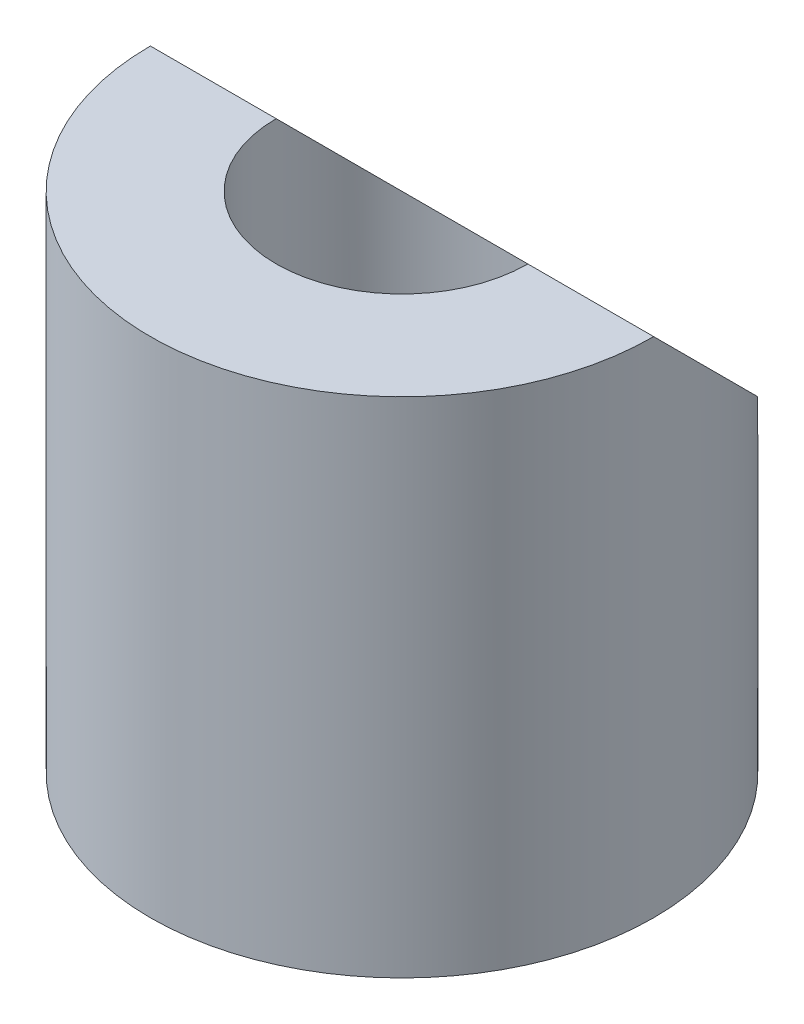
ISO-10303-21;
HEADER;
FILE_DESCRIPTION(('STEP AP214'),'2;1');
FILE_NAME('part.step','',(''),(''),'','','');
FILE_SCHEMA(('AUTOMOTIVE_DESIGN { 1 0 10303 214 1 1 1 1 }'));
ENDSEC;
DATA;
#1=APPLICATION_CONTEXT('core data for automotive mechanical design processes');
#2=APPLICATION_PROTOCOL_DEFINITION('international standard','automotive_design',2000,#1);
#3=PRODUCT_CONTEXT('',#1,'mechanical');
#4=PRODUCT('Part','Part','',(#3));
#5=PRODUCT_RELATED_PRODUCT_CATEGORY('part','',(#4));
#6=PRODUCT_DEFINITION_FORMATION('','',#4);
#7=PRODUCT_DEFINITION_CONTEXT('part definition',#1,'design');
#8=PRODUCT_DEFINITION('design','',#6,#7);
#9=PRODUCT_DEFINITION_SHAPE('','',#8);
#10=(LENGTH_UNIT() NAMED_UNIT(*) SI_UNIT(.MILLI.,.METRE.));
#11=(NAMED_UNIT(*) PLANE_ANGLE_UNIT() SI_UNIT($,.RADIAN.));
#12=(NAMED_UNIT(*) SI_UNIT($,.STERADIAN.) SOLID_ANGLE_UNIT());
#13=UNCERTAINTY_MEASURE_WITH_UNIT(LENGTH_MEASURE(1.E-05),#10,'distance_accuracy_value','');
#14=(GEOMETRIC_REPRESENTATION_CONTEXT(3) GLOBAL_UNCERTAINTY_ASSIGNED_CONTEXT((#13)) GLOBAL_UNIT_ASSIGNED_CONTEXT((#10,
#11,#12)) REPRESENTATION_CONTEXT('',''));
#15=CARTESIAN_POINT('',(0.,0.,0.));
#16=DIRECTION('',(0.,0.,1.));
#17=DIRECTION('',(1.,0.,0.));
#18=AXIS2_PLACEMENT_3D('',#15,#16,#17);
#19=CARTESIAN_POINT('',(0.,4.,0.));
#20=DIRECTION('',(0.,1.,0.));
#21=DIRECTION('',(0.,0.,1.));
#22=AXIS2_PLACEMENT_3D('',#19,#20,#21);
#23=PLANE('',#22);
#24=DIRECTION('',(1.,0.,0.));
#25=VECTOR('',#24,1.);
#26=CARTESIAN_POINT('',(-2.,4.,0.));
#27=LINE('',#26,#25);
#28=CARTESIAN_POINT('',(-2.,4.,0.));
#29=VERTEX_POINT('',#28);
#30=CARTESIAN_POINT('',(-1.,4.,0.));
#31=VERTEX_POINT('',#30);
#32=EDGE_CURVE('E47',#29,#31,#27,.T.);
#33=ORIENTED_EDGE('',*,*,#32,.F.);
#34=CARTESIAN_POINT('',(0.,4.,0.));
#35=DIRECTION('',(0.,1.,0.));
#36=DIRECTION('',(0.,0.,1.));
#37=AXIS2_PLACEMENT_3D('',#34,#35,#36);
#38=CIRCLE('',#37,2.);
#39=CARTESIAN_POINT('',(2.,4.,0.));
#40=VERTEX_POINT('',#39);
#41=EDGE_CURVE('E41',#29,#40,#38,.T.);
#42=ORIENTED_EDGE('',*,*,#41,.T.);
#43=CARTESIAN_POINT('',(1.,4.,0.));
#44=VERTEX_POINT('',#43);
#45=EDGE_CURVE('E63',#44,#40,#27,.T.);
#46=ORIENTED_EDGE('',*,*,#45,.F.);
#47=CARTESIAN_POINT('',(0.,4.,0.));
#48=DIRECTION('',(0.,1.,0.));
#49=DIRECTION('',(0.,0.,1.));
#50=AXIS2_PLACEMENT_3D('',#47,#48,#49);
#51=CIRCLE('',#50,1.);
#52=EDGE_CURVE('E72',#31,#44,#51,.T.);
#53=ORIENTED_EDGE('',*,*,#52,.F.);
#54=EDGE_LOOP('',(#33,#42,#46,#53));
#55=FACE_BOUND('',#54,.T.);
#56=ADVANCED_FACE('F33',(#55),#23,.T.);
#57=CARTESIAN_POINT('',(0.,0.,0.));
#58=DIRECTION('',(0.,1.,0.));
#59=DIRECTION('',(0.,0.,1.));
#60=AXIS2_PLACEMENT_3D('',#57,#58,#59);
#61=PLANE('',#60);
#62=CARTESIAN_POINT('',(0.,0.,0.));
#63=DIRECTION('',(0.,1.,0.));
#64=DIRECTION('',(0.,0.,1.));
#65=AXIS2_PLACEMENT_3D('',#62,#63,#64);
#66=CIRCLE('',#65,2.);
#67=CARTESIAN_POINT('',(0.,0.,2.));
#68=VERTEX_POINT('',#67);
#69=EDGE_CURVE('E69',#68,#68,#66,.T.);
#70=ORIENTED_EDGE('',*,*,#69,.F.);
#71=EDGE_LOOP('',(#70));
#72=FACE_BOUND('',#71,.T.);
#73=CARTESIAN_POINT('',(0.,0.,0.));
#74=DIRECTION('',(0.,1.,0.));
#75=DIRECTION('',(0.,0.,1.));
#76=AXIS2_PLACEMENT_3D('',#73,#74,#75);
#77=CIRCLE('',#76,1.);
#78=CARTESIAN_POINT('',(0.,0.,1.));
#79=VERTEX_POINT('',#78);
#80=EDGE_CURVE('E61',#79,#79,#77,.T.);
#81=ORIENTED_EDGE('',*,*,#80,.T.);
#82=EDGE_LOOP('',(#81));
#83=FACE_BOUND('',#82,.T.);
#84=ADVANCED_FACE('F83',(#72,#83),#61,.F.);
#85=CARTESIAN_POINT('',(0.,4.,0.));
#86=DIRECTION('',(0.,-1.,0.));
#87=DIRECTION('',(0.,0.,-1.));
#88=AXIS2_PLACEMENT_3D('',#85,#86,#87);
#89=CYLINDRICAL_SURFACE('',#88,2.);
#90=CARTESIAN_POINT('',(0.,4.,0.));
#91=DIRECTION('',(0.,-0.707106781186547,0.707106781186547));
#92=DIRECTION('',(0.,-0.707106781186548,-0.707106781186548));
#93=AXIS2_PLACEMENT_3D('',#90,#91,#92);
#94=ELLIPSE('',#93,2.82842712474619,2.);
#95=EDGE_CURVE('E58',#29,#40,#94,.T.);
#96=ORIENTED_EDGE('',*,*,#95,.T.);
#97=ORIENTED_EDGE('',*,*,#41,.F.);
#98=EDGE_LOOP('',(#96,#97));
#99=FACE_BOUND('',#98,.T.);
#100=ORIENTED_EDGE('',*,*,#69,.T.);
#101=EDGE_LOOP('',(#100));
#102=FACE_BOUND('',#101,.T.);
#103=ADVANCED_FACE('F35',(#99,#102),#89,.T.);
#104=CARTESIAN_POINT('',(0.,4.,0.));
#105=DIRECTION('',(0.,-1.,0.));
#106=DIRECTION('',(0.,0.,-1.));
#107=AXIS2_PLACEMENT_3D('',#104,#105,#106);
#108=CYLINDRICAL_SURFACE('',#107,1.);
#109=CARTESIAN_POINT('',(0.,4.,0.));
#110=DIRECTION('',(0.,-0.707106781186547,0.707106781186547));
#111=DIRECTION('',(0.,-0.707106781186548,-0.707106781186548));
#112=AXIS2_PLACEMENT_3D('',#109,#110,#111);
#113=ELLIPSE('',#112,1.4142135623731,1.);
#114=EDGE_CURVE('E11',#31,#44,#113,.T.);
#115=ORIENTED_EDGE('',*,*,#114,.F.);
#116=ORIENTED_EDGE('',*,*,#52,.T.);
#117=EDGE_LOOP('',(#115,#116));
#118=FACE_BOUND('',#117,.T.);
#119=ORIENTED_EDGE('',*,*,#80,.F.);
#120=EDGE_LOOP('',(#119));
#121=FACE_BOUND('',#120,.T.);
#122=ADVANCED_FACE('F77',(#118,#121),#108,.F.);
#123=CARTESIAN_POINT('',(-2.,2.,-2.));
#124=DIRECTION('',(0.,-0.707106781186547,0.707106781186547));
#125=DIRECTION('',(0.,-0.707106781186548,-0.707106781186548));
#126=AXIS2_PLACEMENT_3D('',#123,#124,#125);
#127=PLANE('',#126);
#128=ORIENTED_EDGE('',*,*,#95,.F.);
#129=ORIENTED_EDGE('',*,*,#32,.T.);
#130=ORIENTED_EDGE('',*,*,#114,.T.);
#131=ORIENTED_EDGE('',*,*,#45,.T.);
#132=EDGE_LOOP('',(#128,#129,#130,#131));
#133=FACE_BOUND('',#132,.T.);
#134=ADVANCED_FACE('F64',(#133),#127,.F.);
#135=CLOSED_SHELL('',(#56,#84,#103,#122,#134));
#136=MANIFOLD_SOLID_BREP('B2',#135);
#137=ADVANCED_BREP_SHAPE_REPRESENTATION('',(#18,#136),#14);
#138=SHAPE_DEFINITION_REPRESENTATION(#9,#137);
ENDSEC;
END-ISO-10303-21;
